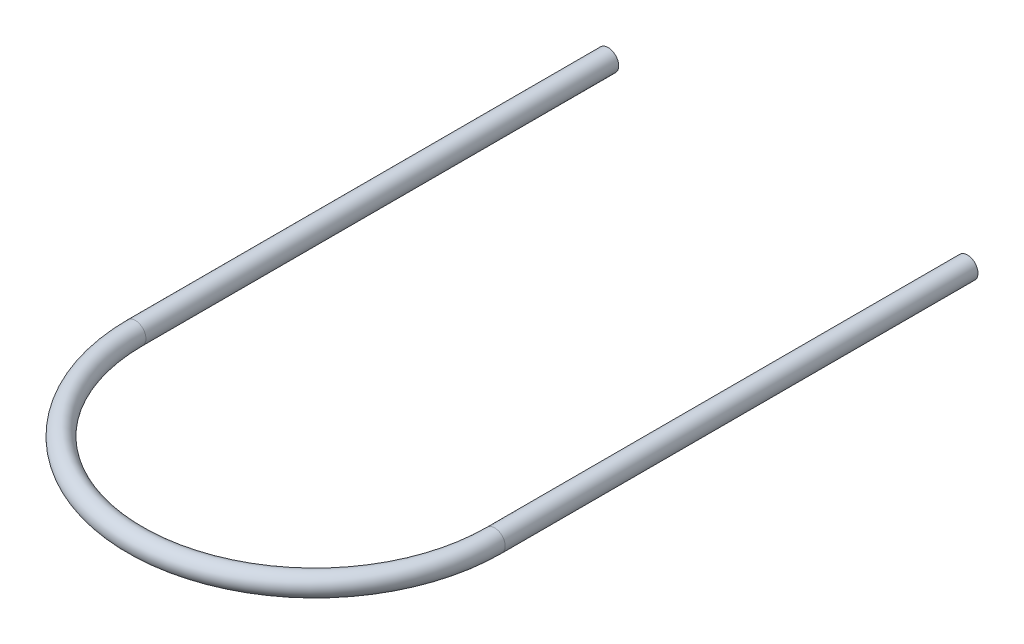
ISO-10303-21;
HEADER;
FILE_DESCRIPTION(('STEP AP214'),'2;1');
FILE_NAME('part.step','',(''),(''),'','','');
FILE_SCHEMA(('AUTOMOTIVE_DESIGN { 1 0 10303 214 1 1 1 1 }'));
ENDSEC;
DATA;
#1=APPLICATION_CONTEXT('core data for automotive mechanical design processes');
#2=APPLICATION_PROTOCOL_DEFINITION('international standard','automotive_design',2000,#1);
#3=PRODUCT_CONTEXT('',#1,'mechanical');
#4=PRODUCT('Part','Part','',(#3));
#5=PRODUCT_RELATED_PRODUCT_CATEGORY('part','',(#4));
#6=PRODUCT_DEFINITION_FORMATION('','',#4);
#7=PRODUCT_DEFINITION_CONTEXT('part definition',#1,'design');
#8=PRODUCT_DEFINITION('design','',#6,#7);
#9=PRODUCT_DEFINITION_SHAPE('','',#8);
#10=(LENGTH_UNIT() NAMED_UNIT(*) SI_UNIT(.MILLI.,.METRE.));
#11=(NAMED_UNIT(*) PLANE_ANGLE_UNIT() SI_UNIT($,.RADIAN.));
#12=(NAMED_UNIT(*) SI_UNIT($,.STERADIAN.) SOLID_ANGLE_UNIT());
#13=UNCERTAINTY_MEASURE_WITH_UNIT(LENGTH_MEASURE(1.E-05),#10,'distance_accuracy_value','');
#14=(GEOMETRIC_REPRESENTATION_CONTEXT(3) GLOBAL_UNCERTAINTY_ASSIGNED_CONTEXT((#13)) GLOBAL_UNIT_ASSIGNED_CONTEXT((#10,
#11,#12)) REPRESENTATION_CONTEXT('',''));
#15=CARTESIAN_POINT('',(0.,0.,0.));
#16=DIRECTION('',(0.,0.,1.));
#17=DIRECTION('',(1.,0.,0.));
#18=AXIS2_PLACEMENT_3D('',#15,#16,#17);
#19=CARTESIAN_POINT('',(-241.3,0.,-635.));
#20=DIRECTION('',(0.,0.,-1.));
#21=DIRECTION('',(-1.,0.,0.));
#22=AXIS2_PLACEMENT_3D('',#19,#20,#21);
#23=PLANE('',#22);
#24=CARTESIAN_POINT('',(-241.3,0.,-635.));
#25=DIRECTION('',(0.,0.,-1.));
#26=DIRECTION('',(-1.,0.,0.));
#27=AXIS2_PLACEMENT_3D('',#24,#25,#26);
#28=CIRCLE('',#27,14.224);
#29=CARTESIAN_POINT('',(-255.524,0.,-635.));
#30=VERTEX_POINT('',#29);
#31=EDGE_CURVE('E65',#30,#30,#28,.T.);
#32=ORIENTED_EDGE('',*,*,#31,.T.);
#33=EDGE_LOOP('',(#32));
#34=FACE_BOUND('',#33,.T.);
#35=ADVANCED_FACE('F48',(#34),#23,.T.);
#36=CARTESIAN_POINT('',(241.3,0.,-635.));
#37=DIRECTION('',(0.,0.,1.));
#38=DIRECTION('',(1.,0.,0.));
#39=AXIS2_PLACEMENT_3D('',#36,#37,#38);
#40=PLANE('',#39);
#41=CARTESIAN_POINT('',(241.3,0.,-635.));
#42=DIRECTION('',(0.,0.,1.));
#43=DIRECTION('',(1.,0.,0.));
#44=AXIS2_PLACEMENT_3D('',#41,#42,#43);
#45=CIRCLE('',#44,14.224);
#46=CARTESIAN_POINT('',(255.524,0.,-635.));
#47=VERTEX_POINT('',#46);
#48=EDGE_CURVE('E11',#47,#47,#45,.T.);
#49=ORIENTED_EDGE('',*,*,#48,.F.);
#50=EDGE_LOOP('',(#49));
#51=FACE_BOUND('',#50,.T.);
#52=ADVANCED_FACE('F76',(#51),#40,.F.);
#53=CARTESIAN_POINT('',(-241.3,0.,-635.));
#54=DIRECTION('',(0.,0.,1.));
#55=DIRECTION('',(1.,0.,0.));
#56=AXIS2_PLACEMENT_3D('',#53,#54,#55);
#57=CYLINDRICAL_SURFACE('',#56,14.224);
#58=CARTESIAN_POINT('',(-241.3,0.,0.));
#59=DIRECTION('',(0.,0.,-1.));
#60=DIRECTION('',(-1.,0.,0.));
#61=AXIS2_PLACEMENT_3D('',#58,#59,#60);
#62=CIRCLE('',#61,14.224);
#63=CARTESIAN_POINT('',(-255.524,0.,0.));
#64=VERTEX_POINT('',#63);
#65=EDGE_CURVE('E60',#64,#64,#62,.T.);
#66=ORIENTED_EDGE('',*,*,#65,.T.);
#67=EDGE_LOOP('',(#66));
#68=FACE_BOUND('',#67,.T.);
#69=ORIENTED_EDGE('',*,*,#31,.F.);
#70=EDGE_LOOP('',(#69));
#71=FACE_BOUND('',#70,.T.);
#72=ADVANCED_FACE('F73',(#68,#71),#57,.T.);
#73=CARTESIAN_POINT('',(0.,0.,0.));
#74=DIRECTION('',(0.,1.,0.));
#75=DIRECTION('',(0.,0.,1.));
#76=AXIS2_PLACEMENT_3D('',#73,#74,#75);
#77=TOROIDAL_SURFACE('',#76,241.3,14.224);
#78=CARTESIAN_POINT('',(241.3,0.,-1.11022302462516E-13));
#79=DIRECTION('',(0.,0.,1.));
#80=DIRECTION('',(1.,0.,0.));
#81=AXIS2_PLACEMENT_3D('',#78,#79,#80);
#82=CIRCLE('',#81,14.224);
#83=CARTESIAN_POINT('',(255.524,0.,-1.17566775028727E-13));
#84=VERTEX_POINT('',#83);
#85=EDGE_CURVE('E55',#84,#84,#82,.T.);
#86=CARTESIAN_POINT('',(0.,0.,0.));
#87=DIRECTION('',(0.,1.,0.));
#88=DIRECTION('',(0.,0.,1.));
#89=AXIS2_PLACEMENT_3D('',#86,#87,#88);
#90=CIRCLE('',#89,255.524);
#91=EDGE_CURVE('',#64,#84,#90,.T.);
#92=ORIENTED_EDGE('',*,*,#65,.F.);
#93=ORIENTED_EDGE('',*,*,#85,.T.);
#94=ORIENTED_EDGE('',*,*,#91,.T.);
#95=ORIENTED_EDGE('',*,*,#91,.F.);
#96=EDGE_LOOP('',(#92,#94,#93,#95));
#97=FACE_BOUND('',#96,.T.);
#98=ADVANCED_FACE('F75',(#97),#77,.T.);
#99=CARTESIAN_POINT('',(241.3,0.,0.));
#100=DIRECTION('',(0.,0.,-1.));
#101=DIRECTION('',(-1.,0.,0.));
#102=AXIS2_PLACEMENT_3D('',#99,#100,#101);
#103=CYLINDRICAL_SURFACE('',#102,14.224);
#104=ORIENTED_EDGE('',*,*,#48,.T.);
#105=EDGE_LOOP('',(#104));
#106=FACE_BOUND('',#105,.T.);
#107=ORIENTED_EDGE('',*,*,#85,.F.);
#108=EDGE_LOOP('',(#107));
#109=FACE_BOUND('',#108,.T.);
#110=ADVANCED_FACE('F83',(#106,#109),#103,.T.);
#111=CLOSED_SHELL('',(#35,#52,#72,#98,#110));
#112=MANIFOLD_SOLID_BREP('B2',#111);
#113=ADVANCED_BREP_SHAPE_REPRESENTATION('',(#18,#112),#14);
#114=SHAPE_DEFINITION_REPRESENTATION(#9,#113);
ENDSEC;
END-ISO-10303-21;
